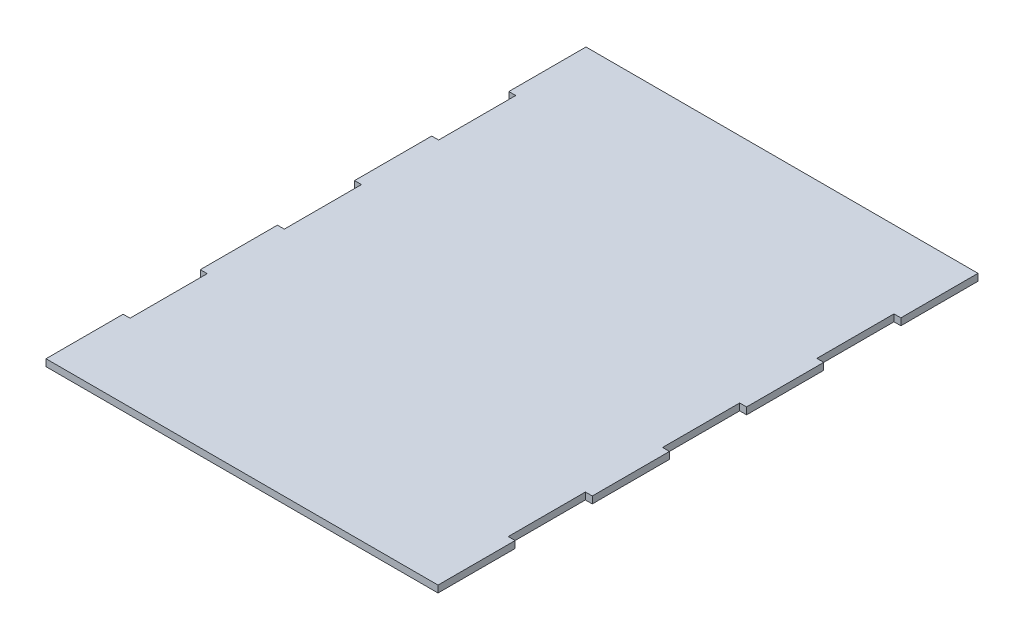
ISO-10303-21;
HEADER;
FILE_DESCRIPTION(('STEP AP214'),'2;1');
FILE_NAME('part.step','',(''),(''),'','','');
FILE_SCHEMA(('AUTOMOTIVE_DESIGN { 1 0 10303 214 1 1 1 1 }'));
ENDSEC;
DATA;
#1=APPLICATION_CONTEXT('core data for automotive mechanical design processes');
#2=APPLICATION_PROTOCOL_DEFINITION('international standard','automotive_design',2000,#1);
#3=PRODUCT_CONTEXT('',#1,'mechanical');
#4=PRODUCT('Part','Part','',(#3));
#5=PRODUCT_RELATED_PRODUCT_CATEGORY('part','',(#4));
#6=PRODUCT_DEFINITION_FORMATION('','',#4);
#7=PRODUCT_DEFINITION_CONTEXT('part definition',#1,'design');
#8=PRODUCT_DEFINITION('design','',#6,#7);
#9=PRODUCT_DEFINITION_SHAPE('','',#8);
#10=(LENGTH_UNIT() NAMED_UNIT(*) SI_UNIT(.MILLI.,.METRE.));
#11=(NAMED_UNIT(*) PLANE_ANGLE_UNIT() SI_UNIT($,.RADIAN.));
#12=(NAMED_UNIT(*) SI_UNIT($,.STERADIAN.) SOLID_ANGLE_UNIT());
#13=UNCERTAINTY_MEASURE_WITH_UNIT(LENGTH_MEASURE(1.E-05),#10,'distance_accuracy_value','');
#14=(GEOMETRIC_REPRESENTATION_CONTEXT(3) GLOBAL_UNCERTAINTY_ASSIGNED_CONTEXT((#13)) GLOBAL_UNIT_ASSIGNED_CONTEXT((#10,
#11,#12)) REPRESENTATION_CONTEXT('',''));
#15=CARTESIAN_POINT('',(0.,0.,0.));
#16=DIRECTION('',(0.,0.,1.));
#17=DIRECTION('',(1.,0.,0.));
#18=AXIS2_PLACEMENT_3D('',#15,#16,#17);
#19=CARTESIAN_POINT('',(-76.7,2.7,-75.4624019285714));
#20=DIRECTION('',(1.,0.,0.));
#21=DIRECTION('',(0.,0.,-1.));
#22=AXIS2_PLACEMENT_3D('',#19,#20,#21);
#23=PLANE('',#22);
#24=DIRECTION('',(0.,0.,1.));
#25=VECTOR('',#24,1.);
#26=CARTESIAN_POINT('',(-76.7,0.,-75.4624019285714));
#27=LINE('',#26,#25);
#28=CARTESIAN_POINT('',(-76.7,0.,-105.6473627));
#29=VERTEX_POINT('',#28);
#30=CARTESIAN_POINT('',(-76.7,0.,-75.4624019285714));
#31=VERTEX_POINT('',#30);
#32=EDGE_CURVE('E249',#29,#31,#27,.T.);
#33=ORIENTED_EDGE('',*,*,#32,.T.);
#34=DIRECTION('',(0.,-1.,0.));
#35=VECTOR('',#34,1.);
#36=CARTESIAN_POINT('',(-76.7,2.7,-75.4624019285714));
#37=LINE('',#36,#35);
#38=CARTESIAN_POINT('',(-76.7,2.7,-75.4624019285714));
#39=VERTEX_POINT('',#38);
#40=EDGE_CURVE('E11',#39,#31,#37,.T.);
#41=ORIENTED_EDGE('',*,*,#40,.F.);
#42=DIRECTION('',(0.,0.,1.));
#43=VECTOR('',#42,1.);
#44=CARTESIAN_POINT('',(-76.7,2.7,-75.4624019285714));
#45=LINE('',#44,#43);
#46=CARTESIAN_POINT('',(-76.7,2.7,-105.6473627));
#47=VERTEX_POINT('',#46);
#48=EDGE_CURVE('E303',#47,#39,#45,.T.);
#49=ORIENTED_EDGE('',*,*,#48,.F.);
#50=DIRECTION('',(0.,-1.,0.));
#51=VECTOR('',#50,1.);
#52=CARTESIAN_POINT('',(-76.7,2.7,-105.6473627));
#53=LINE('',#52,#51);
#54=EDGE_CURVE('E245',#47,#29,#53,.T.);
#55=ORIENTED_EDGE('',*,*,#54,.T.);
#56=EDGE_LOOP('',(#33,#41,#49,#55));
#57=FACE_BOUND('',#56,.T.);
#58=ADVANCED_FACE('F33',(#57),#23,.F.);
#59=CARTESIAN_POINT('',(-76.7,2.7,-75.4624019285714));
#60=DIRECTION('',(0.,0.,-1.));
#61=DIRECTION('',(-1.,0.,0.));
#62=AXIS2_PLACEMENT_3D('',#59,#60,#61);
#63=PLANE('',#62);
#64=DIRECTION('',(1.,0.,0.));
#65=VECTOR('',#64,1.);
#66=CARTESIAN_POINT('',(-76.7,0.,-75.4624019285714));
#67=LINE('',#66,#65);
#68=CARTESIAN_POINT('',(-74.,0.,-75.4624019285714));
#69=VERTEX_POINT('',#68);
#70=EDGE_CURVE('E252',#31,#69,#67,.T.);
#71=ORIENTED_EDGE('',*,*,#70,.T.);
#72=DIRECTION('',(0.,-1.,0.));
#73=VECTOR('',#72,1.);
#74=CARTESIAN_POINT('',(-74.,2.7,-75.4624019285714));
#75=LINE('',#74,#73);
#76=CARTESIAN_POINT('',(-74.,2.7,-75.4624019285714));
#77=VERTEX_POINT('',#76);
#78=EDGE_CURVE('E41',#77,#69,#75,.T.);
#79=ORIENTED_EDGE('',*,*,#78,.F.);
#80=DIRECTION('',(1.,0.,0.));
#81=VECTOR('',#80,1.);
#82=CARTESIAN_POINT('',(-76.7,2.7,-75.4624019285714));
#83=LINE('',#82,#81);
#84=EDGE_CURVE('E152',#39,#77,#83,.T.);
#85=ORIENTED_EDGE('',*,*,#84,.F.);
#86=ORIENTED_EDGE('',*,*,#40,.T.);
#87=EDGE_LOOP('',(#71,#79,#85,#86));
#88=FACE_BOUND('',#87,.T.);
#89=ADVANCED_FACE('F461',(#88),#63,.F.);
#90=CARTESIAN_POINT('',(-74.,2.7,-75.4624019285714));
#91=DIRECTION('',(1.,0.,0.));
#92=DIRECTION('',(0.,0.,-1.));
#93=AXIS2_PLACEMENT_3D('',#90,#91,#92);
#94=PLANE('',#93);
#95=DIRECTION('',(0.,0.,1.));
#96=VECTOR('',#95,1.);
#97=CARTESIAN_POINT('',(-74.,0.,-75.4624019285714));
#98=LINE('',#97,#96);
#99=CARTESIAN_POINT('',(-74.,0.,-45.2774411571429));
#100=VERTEX_POINT('',#99);
#101=EDGE_CURVE('E254',#69,#100,#98,.T.);
#102=ORIENTED_EDGE('',*,*,#101,.T.);
#103=DIRECTION('',(0.,-1.,0.));
#104=VECTOR('',#103,1.);
#105=CARTESIAN_POINT('',(-74.,2.7,-45.2774411571429));
#106=LINE('',#105,#104);
#107=CARTESIAN_POINT('',(-74.,2.7,-45.2774411571429));
#108=VERTEX_POINT('',#107);
#109=EDGE_CURVE('E370',#108,#100,#106,.T.);
#110=ORIENTED_EDGE('',*,*,#109,.F.);
#111=DIRECTION('',(0.,0.,1.));
#112=VECTOR('',#111,1.);
#113=CARTESIAN_POINT('',(-74.,2.7,-75.4624019285714));
#114=LINE('',#113,#112);
#115=EDGE_CURVE('E378',#77,#108,#114,.T.);
#116=ORIENTED_EDGE('',*,*,#115,.F.);
#117=ORIENTED_EDGE('',*,*,#78,.T.);
#118=EDGE_LOOP('',(#102,#110,#116,#117));
#119=FACE_BOUND('',#118,.T.);
#120=ADVANCED_FACE('F376',(#119),#94,.F.);
#121=CARTESIAN_POINT('',(-76.7,2.7,-45.2774411571429));
#122=DIRECTION('',(0.,0.,1.));
#123=DIRECTION('',(1.,0.,0.));
#124=AXIS2_PLACEMENT_3D('',#121,#122,#123);
#125=PLANE('',#124);
#126=DIRECTION('',(-1.,0.,0.));
#127=VECTOR('',#126,1.);
#128=CARTESIAN_POINT('',(-76.7,0.,-45.2774411571429));
#129=LINE('',#128,#127);
#130=CARTESIAN_POINT('',(-76.7,0.,-45.2774411571429));
#131=VERTEX_POINT('',#130);
#132=EDGE_CURVE('E256',#100,#131,#129,.T.);
#133=ORIENTED_EDGE('',*,*,#132,.T.);
#134=DIRECTION('',(0.,-1.,0.));
#135=VECTOR('',#134,1.);
#136=CARTESIAN_POINT('',(-76.7,2.7,-45.2774411571429));
#137=LINE('',#136,#135);
#138=CARTESIAN_POINT('',(-76.7,2.7,-45.2774411571429));
#139=VERTEX_POINT('',#138);
#140=EDGE_CURVE('E367',#139,#131,#137,.T.);
#141=ORIENTED_EDGE('',*,*,#140,.F.);
#142=DIRECTION('',(-1.,0.,0.));
#143=VECTOR('',#142,1.);
#144=CARTESIAN_POINT('',(-76.7,2.7,-45.2774411571429));
#145=LINE('',#144,#143);
#146=EDGE_CURVE('E396',#108,#139,#145,.T.);
#147=ORIENTED_EDGE('',*,*,#146,.F.);
#148=ORIENTED_EDGE('',*,*,#109,.T.);
#149=EDGE_LOOP('',(#133,#141,#147,#148));
#150=FACE_BOUND('',#149,.T.);
#151=ADVANCED_FACE('F387',(#150),#125,.F.);
#152=CARTESIAN_POINT('',(-76.7,2.7,-15.0924803857143));
#153=DIRECTION('',(1.,0.,0.));
#154=DIRECTION('',(0.,0.,-1.));
#155=AXIS2_PLACEMENT_3D('',#152,#153,#154);
#156=PLANE('',#155);
#157=DIRECTION('',(0.,0.,1.));
#158=VECTOR('',#157,1.);
#159=CARTESIAN_POINT('',(-76.7,0.,-15.0924803857143));
#160=LINE('',#159,#158);
#161=CARTESIAN_POINT('',(-76.7,0.,-15.0924803857143));
#162=VERTEX_POINT('',#161);
#163=EDGE_CURVE('E258',#131,#162,#160,.T.);
#164=ORIENTED_EDGE('',*,*,#163,.T.);
#165=DIRECTION('',(0.,-1.,0.));
#166=VECTOR('',#165,1.);
#167=CARTESIAN_POINT('',(-76.7,2.7,-15.0924803857143));
#168=LINE('',#167,#166);
#169=CARTESIAN_POINT('',(-76.7,2.7,-15.0924803857143));
#170=VERTEX_POINT('',#169);
#171=EDGE_CURVE('E364',#170,#162,#168,.T.);
#172=ORIENTED_EDGE('',*,*,#171,.F.);
#173=DIRECTION('',(0.,0.,1.));
#174=VECTOR('',#173,1.);
#175=CARTESIAN_POINT('',(-76.7,2.7,-15.0924803857143));
#176=LINE('',#175,#174);
#177=EDGE_CURVE('E393',#139,#170,#176,.T.);
#178=ORIENTED_EDGE('',*,*,#177,.F.);
#179=ORIENTED_EDGE('',*,*,#140,.T.);
#180=EDGE_LOOP('',(#164,#172,#178,#179));
#181=FACE_BOUND('',#180,.T.);
#182=ADVANCED_FACE('F391',(#181),#156,.F.);
#183=CARTESIAN_POINT('',(-76.7,2.7,-15.0924803857143));
#184=DIRECTION('',(0.,0.,-1.));
#185=DIRECTION('',(-1.,0.,0.));
#186=AXIS2_PLACEMENT_3D('',#183,#184,#185);
#187=PLANE('',#186);
#188=DIRECTION('',(1.,0.,0.));
#189=VECTOR('',#188,1.);
#190=CARTESIAN_POINT('',(-76.7,0.,-15.0924803857143));
#191=LINE('',#190,#189);
#192=CARTESIAN_POINT('',(-74.,0.,-15.0924803857143));
#193=VERTEX_POINT('',#192);
#194=EDGE_CURVE('E260',#162,#193,#191,.T.);
#195=ORIENTED_EDGE('',*,*,#194,.T.);
#196=DIRECTION('',(0.,-1.,0.));
#197=VECTOR('',#196,1.);
#198=CARTESIAN_POINT('',(-74.,2.7,-15.0924803857143));
#199=LINE('',#198,#197);
#200=CARTESIAN_POINT('',(-74.,2.7,-15.0924803857143));
#201=VERTEX_POINT('',#200);
#202=EDGE_CURVE('E361',#201,#193,#199,.T.);
#203=ORIENTED_EDGE('',*,*,#202,.F.);
#204=DIRECTION('',(1.,0.,0.));
#205=VECTOR('',#204,1.);
#206=CARTESIAN_POINT('',(-76.7,2.7,-15.0924803857143));
#207=LINE('',#206,#205);
#208=EDGE_CURVE('E395',#170,#201,#207,.T.);
#209=ORIENTED_EDGE('',*,*,#208,.F.);
#210=ORIENTED_EDGE('',*,*,#171,.T.);
#211=EDGE_LOOP('',(#195,#203,#209,#210));
#212=FACE_BOUND('',#211,.T.);
#213=ADVANCED_FACE('F474',(#212),#187,.F.);
#214=CARTESIAN_POINT('',(-74.,2.7,-15.0924803857143));
#215=DIRECTION('',(1.,0.,0.));
#216=DIRECTION('',(0.,0.,-1.));
#217=AXIS2_PLACEMENT_3D('',#214,#215,#216);
#218=PLANE('',#217);
#219=DIRECTION('',(0.,0.,1.));
#220=VECTOR('',#219,1.);
#221=CARTESIAN_POINT('',(-74.,0.,-15.0924803857143));
#222=LINE('',#221,#220);
#223=CARTESIAN_POINT('',(-74.,0.,15.0924803857143));
#224=VERTEX_POINT('',#223);
#225=EDGE_CURVE('E262',#193,#224,#222,.T.);
#226=ORIENTED_EDGE('',*,*,#225,.T.);
#227=DIRECTION('',(0.,-1.,0.));
#228=VECTOR('',#227,1.);
#229=CARTESIAN_POINT('',(-74.,2.7,15.0924803857143));
#230=LINE('',#229,#228);
#231=CARTESIAN_POINT('',(-74.,2.7,15.0924803857143));
#232=VERTEX_POINT('',#231);
#233=EDGE_CURVE('E358',#232,#224,#230,.T.);
#234=ORIENTED_EDGE('',*,*,#233,.F.);
#235=DIRECTION('',(0.,0.,1.));
#236=VECTOR('',#235,1.);
#237=CARTESIAN_POINT('',(-74.,2.7,-15.0924803857143));
#238=LINE('',#237,#236);
#239=EDGE_CURVE('E398',#201,#232,#238,.T.);
#240=ORIENTED_EDGE('',*,*,#239,.F.);
#241=ORIENTED_EDGE('',*,*,#202,.T.);
#242=EDGE_LOOP('',(#226,#234,#240,#241));
#243=FACE_BOUND('',#242,.T.);
#244=ADVANCED_FACE('F477',(#243),#218,.F.);
#245=CARTESIAN_POINT('',(-76.7,2.7,15.0924803857143));
#246=DIRECTION('',(0.,0.,1.));
#247=DIRECTION('',(1.,0.,0.));
#248=AXIS2_PLACEMENT_3D('',#245,#246,#247);
#249=PLANE('',#248);
#250=DIRECTION('',(-1.,0.,0.));
#251=VECTOR('',#250,1.);
#252=CARTESIAN_POINT('',(-76.7,0.,15.0924803857143));
#253=LINE('',#252,#251);
#254=CARTESIAN_POINT('',(-76.7,0.,15.0924803857143));
#255=VERTEX_POINT('',#254);
#256=EDGE_CURVE('E264',#224,#255,#253,.T.);
#257=ORIENTED_EDGE('',*,*,#256,.T.);
#258=DIRECTION('',(0.,-1.,0.));
#259=VECTOR('',#258,1.);
#260=CARTESIAN_POINT('',(-76.7,2.7,15.0924803857143));
#261=LINE('',#260,#259);
#262=CARTESIAN_POINT('',(-76.7,2.7,15.0924803857143));
#263=VERTEX_POINT('',#262);
#264=EDGE_CURVE('E355',#263,#255,#261,.T.);
#265=ORIENTED_EDGE('',*,*,#264,.F.);
#266=DIRECTION('',(-1.,0.,0.));
#267=VECTOR('',#266,1.);
#268=CARTESIAN_POINT('',(-76.7,2.7,15.0924803857143));
#269=LINE('',#268,#267);
#270=EDGE_CURVE('E404',#232,#263,#269,.T.);
#271=ORIENTED_EDGE('',*,*,#270,.F.);
#272=ORIENTED_EDGE('',*,*,#233,.T.);
#273=EDGE_LOOP('',(#257,#265,#271,#272));
#274=FACE_BOUND('',#273,.T.);
#275=ADVANCED_FACE('F481',(#274),#249,.F.);
#276=CARTESIAN_POINT('',(-76.7,2.7,45.2774411571429));
#277=DIRECTION('',(1.,0.,0.));
#278=DIRECTION('',(0.,0.,-1.));
#279=AXIS2_PLACEMENT_3D('',#276,#277,#278);
#280=PLANE('',#279);
#281=DIRECTION('',(0.,0.,1.));
#282=VECTOR('',#281,1.);
#283=CARTESIAN_POINT('',(-76.7,0.,45.2774411571429));
#284=LINE('',#283,#282);
#285=CARTESIAN_POINT('',(-76.7,0.,45.2774411571429));
#286=VERTEX_POINT('',#285);
#287=EDGE_CURVE('E266',#255,#286,#284,.T.);
#288=ORIENTED_EDGE('',*,*,#287,.T.);
#289=DIRECTION('',(0.,-1.,0.));
#290=VECTOR('',#289,1.);
#291=CARTESIAN_POINT('',(-76.7,2.7,45.2774411571429));
#292=LINE('',#291,#290);
#293=CARTESIAN_POINT('',(-76.7,2.7,45.2774411571429));
#294=VERTEX_POINT('',#293);
#295=EDGE_CURVE('E352',#294,#286,#292,.T.);
#296=ORIENTED_EDGE('',*,*,#295,.F.);
#297=DIRECTION('',(0.,0.,1.));
#298=VECTOR('',#297,1.);
#299=CARTESIAN_POINT('',(-76.7,2.7,45.2774411571429));
#300=LINE('',#299,#298);
#301=EDGE_CURVE('E406',#263,#294,#300,.T.);
#302=ORIENTED_EDGE('',*,*,#301,.F.);
#303=ORIENTED_EDGE('',*,*,#264,.T.);
#304=EDGE_LOOP('',(#288,#296,#302,#303));
#305=FACE_BOUND('',#304,.T.);
#306=ADVANCED_FACE('F485',(#305),#280,.F.);
#307=CARTESIAN_POINT('',(-76.7,2.7,45.2774411571429));
#308=DIRECTION('',(0.,0.,-1.));
#309=DIRECTION('',(-1.,0.,0.));
#310=AXIS2_PLACEMENT_3D('',#307,#308,#309);
#311=PLANE('',#310);
#312=DIRECTION('',(1.,0.,0.));
#313=VECTOR('',#312,1.);
#314=CARTESIAN_POINT('',(-76.7,0.,45.2774411571429));
#315=LINE('',#314,#313);
#316=CARTESIAN_POINT('',(-74.,0.,45.2774411571428));
#317=VERTEX_POINT('',#316);
#318=EDGE_CURVE('E268',#286,#317,#315,.T.);
#319=ORIENTED_EDGE('',*,*,#318,.T.);
#320=DIRECTION('',(0.,-1.,0.));
#321=VECTOR('',#320,1.);
#322=CARTESIAN_POINT('',(-74.,2.7,45.2774411571428));
#323=LINE('',#322,#321);
#324=CARTESIAN_POINT('',(-74.,2.7,45.2774411571428));
#325=VERTEX_POINT('',#324);
#326=EDGE_CURVE('E349',#325,#317,#323,.T.);
#327=ORIENTED_EDGE('',*,*,#326,.F.);
#328=DIRECTION('',(1.,0.,0.));
#329=VECTOR('',#328,1.);
#330=CARTESIAN_POINT('',(-76.7,2.7,45.2774411571429));
#331=LINE('',#330,#329);
#332=EDGE_CURVE('E408',#294,#325,#331,.T.);
#333=ORIENTED_EDGE('',*,*,#332,.F.);
#334=ORIENTED_EDGE('',*,*,#295,.T.);
#335=EDGE_LOOP('',(#319,#327,#333,#334));
#336=FACE_BOUND('',#335,.T.);
#337=ADVANCED_FACE('F489',(#336),#311,.F.);
#338=CARTESIAN_POINT('',(-74.,2.7,45.2774411571428));
#339=DIRECTION('',(1.,0.,0.));
#340=DIRECTION('',(0.,0.,-1.));
#341=AXIS2_PLACEMENT_3D('',#338,#339,#340);
#342=PLANE('',#341);
#343=DIRECTION('',(0.,0.,1.));
#344=VECTOR('',#343,1.);
#345=CARTESIAN_POINT('',(-74.,0.,45.2774411571428));
#346=LINE('',#345,#344);
#347=CARTESIAN_POINT('',(-74.,0.,75.4624019285714));
#348=VERTEX_POINT('',#347);
#349=EDGE_CURVE('E270',#317,#348,#346,.T.);
#350=ORIENTED_EDGE('',*,*,#349,.T.);
#351=DIRECTION('',(0.,-1.,0.));
#352=VECTOR('',#351,1.);
#353=CARTESIAN_POINT('',(-74.,2.7,75.4624019285714));
#354=LINE('',#353,#352);
#355=CARTESIAN_POINT('',(-74.,2.7,75.4624019285714));
#356=VERTEX_POINT('',#355);
#357=EDGE_CURVE('E346',#356,#348,#354,.T.);
#358=ORIENTED_EDGE('',*,*,#357,.F.);
#359=DIRECTION('',(0.,0.,1.));
#360=VECTOR('',#359,1.);
#361=CARTESIAN_POINT('',(-74.,2.7,45.2774411571428));
#362=LINE('',#361,#360);
#363=EDGE_CURVE('E410',#325,#356,#362,.T.);
#364=ORIENTED_EDGE('',*,*,#363,.F.);
#365=ORIENTED_EDGE('',*,*,#326,.T.);
#366=EDGE_LOOP('',(#350,#358,#364,#365));
#367=FACE_BOUND('',#366,.T.);
#368=ADVANCED_FACE('F493',(#367),#342,.F.);
#369=CARTESIAN_POINT('',(-76.7,2.7,75.4624019285714));
#370=DIRECTION('',(0.,0.,1.));
#371=DIRECTION('',(1.,0.,0.));
#372=AXIS2_PLACEMENT_3D('',#369,#370,#371);
#373=PLANE('',#372);
#374=DIRECTION('',(-1.,0.,0.));
#375=VECTOR('',#374,1.);
#376=CARTESIAN_POINT('',(-76.7,0.,75.4624019285714));
#377=LINE('',#376,#375);
#378=CARTESIAN_POINT('',(-76.7,0.,75.4624019285714));
#379=VERTEX_POINT('',#378);
#380=EDGE_CURVE('E272',#348,#379,#377,.T.);
#381=ORIENTED_EDGE('',*,*,#380,.T.);
#382=DIRECTION('',(0.,-1.,0.));
#383=VECTOR('',#382,1.);
#384=CARTESIAN_POINT('',(-76.7,2.7,75.4624019285714));
#385=LINE('',#384,#383);
#386=CARTESIAN_POINT('',(-76.7,2.7,75.4624019285714));
#387=VERTEX_POINT('',#386);
#388=EDGE_CURVE('E343',#387,#379,#385,.T.);
#389=ORIENTED_EDGE('',*,*,#388,.F.);
#390=DIRECTION('',(-1.,0.,0.));
#391=VECTOR('',#390,1.);
#392=CARTESIAN_POINT('',(-76.7,2.7,75.4624019285714));
#393=LINE('',#392,#391);
#394=EDGE_CURVE('E412',#356,#387,#393,.T.);
#395=ORIENTED_EDGE('',*,*,#394,.F.);
#396=ORIENTED_EDGE('',*,*,#357,.T.);
#397=EDGE_LOOP('',(#381,#389,#395,#396));
#398=FACE_BOUND('',#397,.T.);
#399=ADVANCED_FACE('F497',(#398),#373,.F.);
#400=CARTESIAN_POINT('',(-76.7,2.7,105.6473627));
#401=DIRECTION('',(1.,0.,0.));
#402=DIRECTION('',(0.,0.,-1.));
#403=AXIS2_PLACEMENT_3D('',#400,#401,#402);
#404=PLANE('',#403);
#405=DIRECTION('',(0.,0.,1.));
#406=VECTOR('',#405,1.);
#407=CARTESIAN_POINT('',(-76.7,0.,105.6473627));
#408=LINE('',#407,#406);
#409=CARTESIAN_POINT('',(-76.7,0.,105.6473627));
#410=VERTEX_POINT('',#409);
#411=EDGE_CURVE('E274',#379,#410,#408,.T.);
#412=ORIENTED_EDGE('',*,*,#411,.T.);
#413=DIRECTION('',(0.,-1.,0.));
#414=VECTOR('',#413,1.);
#415=CARTESIAN_POINT('',(-76.7,2.7,105.6473627));
#416=LINE('',#415,#414);
#417=CARTESIAN_POINT('',(-76.7,2.7,105.6473627));
#418=VERTEX_POINT('',#417);
#419=EDGE_CURVE('E340',#418,#410,#416,.T.);
#420=ORIENTED_EDGE('',*,*,#419,.F.);
#421=DIRECTION('',(0.,0.,1.));
#422=VECTOR('',#421,1.);
#423=CARTESIAN_POINT('',(-76.7,2.7,105.6473627));
#424=LINE('',#423,#422);
#425=EDGE_CURVE('E414',#387,#418,#424,.T.);
#426=ORIENTED_EDGE('',*,*,#425,.F.);
#427=ORIENTED_EDGE('',*,*,#388,.T.);
#428=EDGE_LOOP('',(#412,#420,#426,#427));
#429=FACE_BOUND('',#428,.T.);
#430=ADVANCED_FACE('F501',(#429),#404,.F.);
#431=CARTESIAN_POINT('',(76.7,2.7,105.6473627));
#432=DIRECTION('',(0.,0.,-1.));
#433=DIRECTION('',(-1.,0.,0.));
#434=AXIS2_PLACEMENT_3D('',#431,#432,#433);
#435=PLANE('',#434);
#436=DIRECTION('',(1.,0.,0.));
#437=VECTOR('',#436,1.);
#438=CARTESIAN_POINT('',(76.7,0.,105.6473627));
#439=LINE('',#438,#437);
#440=CARTESIAN_POINT('',(76.7,0.,105.6473627));
#441=VERTEX_POINT('',#440);
#442=EDGE_CURVE('E276',#410,#441,#439,.T.);
#443=ORIENTED_EDGE('',*,*,#442,.T.);
#444=DIRECTION('',(0.,-1.,0.));
#445=VECTOR('',#444,1.);
#446=CARTESIAN_POINT('',(76.7,2.7,105.6473627));
#447=LINE('',#446,#445);
#448=CARTESIAN_POINT('',(76.7,2.7,105.6473627));
#449=VERTEX_POINT('',#448);
#450=EDGE_CURVE('E337',#449,#441,#447,.T.);
#451=ORIENTED_EDGE('',*,*,#450,.F.);
#452=DIRECTION('',(1.,0.,0.));
#453=VECTOR('',#452,1.);
#454=CARTESIAN_POINT('',(76.7,2.7,105.6473627));
#455=LINE('',#454,#453);
#456=EDGE_CURVE('E416',#418,#449,#455,.T.);
#457=ORIENTED_EDGE('',*,*,#456,.F.);
#458=ORIENTED_EDGE('',*,*,#419,.T.);
#459=EDGE_LOOP('',(#443,#451,#457,#458));
#460=FACE_BOUND('',#459,.T.);
#461=ADVANCED_FACE('F505',(#460),#435,.F.);
#462=CARTESIAN_POINT('',(76.7,2.7,105.6473627));
#463=DIRECTION('',(-1.,0.,0.));
#464=DIRECTION('',(0.,0.,1.));
#465=AXIS2_PLACEMENT_3D('',#462,#463,#464);
#466=PLANE('',#465);
#467=DIRECTION('',(0.,0.,-1.));
#468=VECTOR('',#467,1.);
#469=CARTESIAN_POINT('',(76.7,0.,105.6473627));
#470=LINE('',#469,#468);
#471=CARTESIAN_POINT('',(76.7,0.,75.4624019285714));
#472=VERTEX_POINT('',#471);
#473=EDGE_CURVE('E278',#441,#472,#470,.T.);
#474=ORIENTED_EDGE('',*,*,#473,.T.);
#475=DIRECTION('',(0.,-1.,0.));
#476=VECTOR('',#475,1.);
#477=CARTESIAN_POINT('',(76.7,2.7,75.4624019285714));
#478=LINE('',#477,#476);
#479=CARTESIAN_POINT('',(76.7,2.7,75.4624019285714));
#480=VERTEX_POINT('',#479);
#481=EDGE_CURVE('E334',#480,#472,#478,.T.);
#482=ORIENTED_EDGE('',*,*,#481,.F.);
#483=DIRECTION('',(0.,0.,-1.));
#484=VECTOR('',#483,1.);
#485=CARTESIAN_POINT('',(76.7,2.7,105.6473627));
#486=LINE('',#485,#484);
#487=EDGE_CURVE('E418',#449,#480,#486,.T.);
#488=ORIENTED_EDGE('',*,*,#487,.F.);
#489=ORIENTED_EDGE('',*,*,#450,.T.);
#490=EDGE_LOOP('',(#474,#482,#488,#489));
#491=FACE_BOUND('',#490,.T.);
#492=ADVANCED_FACE('F509',(#491),#466,.F.);
#493=CARTESIAN_POINT('',(76.7,2.7,75.4624019285714));
#494=DIRECTION('',(0.,0.,1.));
#495=DIRECTION('',(1.,0.,0.));
#496=AXIS2_PLACEMENT_3D('',#493,#494,#495);
#497=PLANE('',#496);
#498=DIRECTION('',(-1.,0.,0.));
#499=VECTOR('',#498,1.);
#500=CARTESIAN_POINT('',(76.7,0.,75.4624019285714));
#501=LINE('',#500,#499);
#502=CARTESIAN_POINT('',(74.,0.,75.4624019285714));
#503=VERTEX_POINT('',#502);
#504=EDGE_CURVE('E280',#472,#503,#501,.T.);
#505=ORIENTED_EDGE('',*,*,#504,.T.);
#506=DIRECTION('',(0.,-1.,0.));
#507=VECTOR('',#506,1.);
#508=CARTESIAN_POINT('',(74.,2.7,75.4624019285714));
#509=LINE('',#508,#507);
#510=CARTESIAN_POINT('',(74.,2.7,75.4624019285714));
#511=VERTEX_POINT('',#510);
#512=EDGE_CURVE('E331',#511,#503,#509,.T.);
#513=ORIENTED_EDGE('',*,*,#512,.F.);
#514=DIRECTION('',(-1.,0.,0.));
#515=VECTOR('',#514,1.);
#516=CARTESIAN_POINT('',(76.7,2.7,75.4624019285714));
#517=LINE('',#516,#515);
#518=EDGE_CURVE('E420',#480,#511,#517,.T.);
#519=ORIENTED_EDGE('',*,*,#518,.F.);
#520=ORIENTED_EDGE('',*,*,#481,.T.);
#521=EDGE_LOOP('',(#505,#513,#519,#520));
#522=FACE_BOUND('',#521,.T.);
#523=ADVANCED_FACE('F513',(#522),#497,.F.);
#524=CARTESIAN_POINT('',(74.,2.7,45.2774411571428));
#525=DIRECTION('',(-1.,0.,0.));
#526=DIRECTION('',(0.,0.,1.));
#527=AXIS2_PLACEMENT_3D('',#524,#525,#526);
#528=PLANE('',#527);
#529=DIRECTION('',(0.,0.,-1.));
#530=VECTOR('',#529,1.);
#531=CARTESIAN_POINT('',(74.,0.,45.2774411571428));
#532=LINE('',#531,#530);
#533=CARTESIAN_POINT('',(74.,0.,45.2774411571428));
#534=VERTEX_POINT('',#533);
#535=EDGE_CURVE('E282',#503,#534,#532,.T.);
#536=ORIENTED_EDGE('',*,*,#535,.T.);
#537=DIRECTION('',(0.,-1.,0.));
#538=VECTOR('',#537,1.);
#539=CARTESIAN_POINT('',(74.,2.7,45.2774411571428));
#540=LINE('',#539,#538);
#541=CARTESIAN_POINT('',(74.,2.7,45.2774411571428));
#542=VERTEX_POINT('',#541);
#543=EDGE_CURVE('E328',#542,#534,#540,.T.);
#544=ORIENTED_EDGE('',*,*,#543,.F.);
#545=DIRECTION('',(0.,0.,-1.));
#546=VECTOR('',#545,1.);
#547=CARTESIAN_POINT('',(74.,2.7,45.2774411571428));
#548=LINE('',#547,#546);
#549=EDGE_CURVE('E422',#511,#542,#548,.T.);
#550=ORIENTED_EDGE('',*,*,#549,.F.);
#551=ORIENTED_EDGE('',*,*,#512,.T.);
#552=EDGE_LOOP('',(#536,#544,#550,#551));
#553=FACE_BOUND('',#552,.T.);
#554=ADVANCED_FACE('F517',(#553),#528,.F.);
#555=CARTESIAN_POINT('',(76.7,2.7,45.2774411571429));
#556=DIRECTION('',(0.,0.,-1.));
#557=DIRECTION('',(-1.,0.,0.));
#558=AXIS2_PLACEMENT_3D('',#555,#556,#557);
#559=PLANE('',#558);
#560=DIRECTION('',(1.,0.,0.));
#561=VECTOR('',#560,1.);
#562=CARTESIAN_POINT('',(76.7,0.,45.2774411571429));
#563=LINE('',#562,#561);
#564=CARTESIAN_POINT('',(76.7,0.,45.2774411571429));
#565=VERTEX_POINT('',#564);
#566=EDGE_CURVE('E284',#534,#565,#563,.T.);
#567=ORIENTED_EDGE('',*,*,#566,.T.);
#568=DIRECTION('',(0.,-1.,0.));
#569=VECTOR('',#568,1.);
#570=CARTESIAN_POINT('',(76.7,2.7,45.2774411571429));
#571=LINE('',#570,#569);
#572=CARTESIAN_POINT('',(76.7,2.7,45.2774411571429));
#573=VERTEX_POINT('',#572);
#574=EDGE_CURVE('E325',#573,#565,#571,.T.);
#575=ORIENTED_EDGE('',*,*,#574,.F.);
#576=DIRECTION('',(1.,0.,0.));
#577=VECTOR('',#576,1.);
#578=CARTESIAN_POINT('',(76.7,2.7,45.2774411571429));
#579=LINE('',#578,#577);
#580=EDGE_CURVE('E424',#542,#573,#579,.T.);
#581=ORIENTED_EDGE('',*,*,#580,.F.);
#582=ORIENTED_EDGE('',*,*,#543,.T.);
#583=EDGE_LOOP('',(#567,#575,#581,#582));
#584=FACE_BOUND('',#583,.T.);
#585=ADVANCED_FACE('F521',(#584),#559,.F.);
#586=CARTESIAN_POINT('',(76.7,2.7,45.2774411571429));
#587=DIRECTION('',(-1.,0.,0.));
#588=DIRECTION('',(0.,0.,1.));
#589=AXIS2_PLACEMENT_3D('',#586,#587,#588);
#590=PLANE('',#589);
#591=DIRECTION('',(0.,0.,-1.));
#592=VECTOR('',#591,1.);
#593=CARTESIAN_POINT('',(76.7,0.,45.2774411571429));
#594=LINE('',#593,#592);
#595=CARTESIAN_POINT('',(76.7,0.,15.0924803857143));
#596=VERTEX_POINT('',#595);
#597=EDGE_CURVE('E286',#565,#596,#594,.T.);
#598=ORIENTED_EDGE('',*,*,#597,.T.);
#599=DIRECTION('',(0.,-1.,0.));
#600=VECTOR('',#599,1.);
#601=CARTESIAN_POINT('',(76.7,2.7,15.0924803857143));
#602=LINE('',#601,#600);
#603=CARTESIAN_POINT('',(76.7,2.7,15.0924803857143));
#604=VERTEX_POINT('',#603);
#605=EDGE_CURVE('E322',#604,#596,#602,.T.);
#606=ORIENTED_EDGE('',*,*,#605,.F.);
#607=DIRECTION('',(0.,0.,-1.));
#608=VECTOR('',#607,1.);
#609=CARTESIAN_POINT('',(76.7,2.7,45.2774411571429));
#610=LINE('',#609,#608);
#611=EDGE_CURVE('E426',#573,#604,#610,.T.);
#612=ORIENTED_EDGE('',*,*,#611,.F.);
#613=ORIENTED_EDGE('',*,*,#574,.T.);
#614=EDGE_LOOP('',(#598,#606,#612,#613));
#615=FACE_BOUND('',#614,.T.);
#616=ADVANCED_FACE('F525',(#615),#590,.F.);
#617=CARTESIAN_POINT('',(76.7,2.7,15.0924803857143));
#618=DIRECTION('',(0.,0.,1.));
#619=DIRECTION('',(1.,0.,0.));
#620=AXIS2_PLACEMENT_3D('',#617,#618,#619);
#621=PLANE('',#620);
#622=DIRECTION('',(-1.,0.,0.));
#623=VECTOR('',#622,1.);
#624=CARTESIAN_POINT('',(76.7,0.,15.0924803857143));
#625=LINE('',#624,#623);
#626=CARTESIAN_POINT('',(74.,0.,15.0924803857143));
#627=VERTEX_POINT('',#626);
#628=EDGE_CURVE('E288',#596,#627,#625,.T.);
#629=ORIENTED_EDGE('',*,*,#628,.T.);
#630=DIRECTION('',(0.,-1.,0.));
#631=VECTOR('',#630,1.);
#632=CARTESIAN_POINT('',(74.,2.7,15.0924803857143));
#633=LINE('',#632,#631);
#634=CARTESIAN_POINT('',(74.,2.7,15.0924803857143));
#635=VERTEX_POINT('',#634);
#636=EDGE_CURVE('E319',#635,#627,#633,.T.);
#637=ORIENTED_EDGE('',*,*,#636,.F.);
#638=DIRECTION('',(-1.,0.,0.));
#639=VECTOR('',#638,1.);
#640=CARTESIAN_POINT('',(76.7,2.7,15.0924803857143));
#641=LINE('',#640,#639);
#642=EDGE_CURVE('E428',#604,#635,#641,.T.);
#643=ORIENTED_EDGE('',*,*,#642,.F.);
#644=ORIENTED_EDGE('',*,*,#605,.T.);
#645=EDGE_LOOP('',(#629,#637,#643,#644));
#646=FACE_BOUND('',#645,.T.);
#647=ADVANCED_FACE('F529',(#646),#621,.F.);
#648=CARTESIAN_POINT('',(74.,2.7,-15.0924803857143));
#649=DIRECTION('',(-1.,0.,0.));
#650=DIRECTION('',(0.,0.,1.));
#651=AXIS2_PLACEMENT_3D('',#648,#649,#650);
#652=PLANE('',#651);
#653=DIRECTION('',(0.,0.,-1.));
#654=VECTOR('',#653,1.);
#655=CARTESIAN_POINT('',(74.,0.,-15.0924803857143));
#656=LINE('',#655,#654);
#657=CARTESIAN_POINT('',(74.,0.,-15.0924803857143));
#658=VERTEX_POINT('',#657);
#659=EDGE_CURVE('E290',#627,#658,#656,.T.);
#660=ORIENTED_EDGE('',*,*,#659,.T.);
#661=DIRECTION('',(0.,-1.,0.));
#662=VECTOR('',#661,1.);
#663=CARTESIAN_POINT('',(74.,2.7,-15.0924803857143));
#664=LINE('',#663,#662);
#665=CARTESIAN_POINT('',(74.,2.7,-15.0924803857143));
#666=VERTEX_POINT('',#665);
#667=EDGE_CURVE('E316',#666,#658,#664,.T.);
#668=ORIENTED_EDGE('',*,*,#667,.F.);
#669=DIRECTION('',(0.,0.,-1.));
#670=VECTOR('',#669,1.);
#671=CARTESIAN_POINT('',(74.,2.7,-15.0924803857143));
#672=LINE('',#671,#670);
#673=EDGE_CURVE('E430',#635,#666,#672,.T.);
#674=ORIENTED_EDGE('',*,*,#673,.F.);
#675=ORIENTED_EDGE('',*,*,#636,.T.);
#676=EDGE_LOOP('',(#660,#668,#674,#675));
#677=FACE_BOUND('',#676,.T.);
#678=ADVANCED_FACE('F533',(#677),#652,.F.);
#679=CARTESIAN_POINT('',(76.7,2.7,-15.0924803857143));
#680=DIRECTION('',(0.,0.,-1.));
#681=DIRECTION('',(-1.,0.,0.));
#682=AXIS2_PLACEMENT_3D('',#679,#680,#681);
#683=PLANE('',#682);
#684=DIRECTION('',(1.,0.,0.));
#685=VECTOR('',#684,1.);
#686=CARTESIAN_POINT('',(76.7,0.,-15.0924803857143));
#687=LINE('',#686,#685);
#688=CARTESIAN_POINT('',(76.7,0.,-15.0924803857143));
#689=VERTEX_POINT('',#688);
#690=EDGE_CURVE('E292',#658,#689,#687,.T.);
#691=ORIENTED_EDGE('',*,*,#690,.T.);
#692=DIRECTION('',(0.,-1.,0.));
#693=VECTOR('',#692,1.);
#694=CARTESIAN_POINT('',(76.7,2.7,-15.0924803857143));
#695=LINE('',#694,#693);
#696=CARTESIAN_POINT('',(76.7,2.7,-15.0924803857143));
#697=VERTEX_POINT('',#696);
#698=EDGE_CURVE('E313',#697,#689,#695,.T.);
#699=ORIENTED_EDGE('',*,*,#698,.F.);
#700=DIRECTION('',(1.,0.,0.));
#701=VECTOR('',#700,1.);
#702=CARTESIAN_POINT('',(76.7,2.7,-15.0924803857143));
#703=LINE('',#702,#701);
#704=EDGE_CURVE('E432',#666,#697,#703,.T.);
#705=ORIENTED_EDGE('',*,*,#704,.F.);
#706=ORIENTED_EDGE('',*,*,#667,.T.);
#707=EDGE_LOOP('',(#691,#699,#705,#706));
#708=FACE_BOUND('',#707,.T.);
#709=ADVANCED_FACE('F537',(#708),#683,.F.);
#710=CARTESIAN_POINT('',(76.7,2.7,-15.0924803857143));
#711=DIRECTION('',(-1.,0.,0.));
#712=DIRECTION('',(0.,0.,1.));
#713=AXIS2_PLACEMENT_3D('',#710,#711,#712);
#714=PLANE('',#713);
#715=DIRECTION('',(0.,0.,-1.));
#716=VECTOR('',#715,1.);
#717=CARTESIAN_POINT('',(76.7,0.,-15.0924803857143));
#718=LINE('',#717,#716);
#719=CARTESIAN_POINT('',(76.7,0.,-45.2774411571429));
#720=VERTEX_POINT('',#719);
#721=EDGE_CURVE('E294',#689,#720,#718,.T.);
#722=ORIENTED_EDGE('',*,*,#721,.T.);
#723=DIRECTION('',(0.,-1.,0.));
#724=VECTOR('',#723,1.);
#725=CARTESIAN_POINT('',(76.7,2.7,-45.2774411571429));
#726=LINE('',#725,#724);
#727=CARTESIAN_POINT('',(76.7,2.7,-45.2774411571429));
#728=VERTEX_POINT('',#727);
#729=EDGE_CURVE('E310',#728,#720,#726,.T.);
#730=ORIENTED_EDGE('',*,*,#729,.F.);
#731=DIRECTION('',(0.,0.,-1.));
#732=VECTOR('',#731,1.);
#733=CARTESIAN_POINT('',(76.7,2.7,-15.0924803857143));
#734=LINE('',#733,#732);
#735=EDGE_CURVE('E434',#697,#728,#734,.T.);
#736=ORIENTED_EDGE('',*,*,#735,.F.);
#737=ORIENTED_EDGE('',*,*,#698,.T.);
#738=EDGE_LOOP('',(#722,#730,#736,#737));
#739=FACE_BOUND('',#738,.T.);
#740=ADVANCED_FACE('F541',(#739),#714,.F.);
#741=CARTESIAN_POINT('',(76.7,2.7,-45.2774411571429));
#742=DIRECTION('',(0.,0.,1.));
#743=DIRECTION('',(1.,0.,0.));
#744=AXIS2_PLACEMENT_3D('',#741,#742,#743);
#745=PLANE('',#744);
#746=DIRECTION('',(-1.,0.,0.));
#747=VECTOR('',#746,1.);
#748=CARTESIAN_POINT('',(76.7,0.,-45.2774411571429));
#749=LINE('',#748,#747);
#750=CARTESIAN_POINT('',(74.,0.,-45.2774411571429));
#751=VERTEX_POINT('',#750);
#752=EDGE_CURVE('E296',#720,#751,#749,.T.);
#753=ORIENTED_EDGE('',*,*,#752,.T.);
#754=DIRECTION('',(0.,-1.,0.));
#755=VECTOR('',#754,1.);
#756=CARTESIAN_POINT('',(74.,2.7,-45.2774411571429));
#757=LINE('',#756,#755);
#758=CARTESIAN_POINT('',(74.,2.7,-45.2774411571429));
#759=VERTEX_POINT('',#758);
#760=EDGE_CURVE('E307',#759,#751,#757,.T.);
#761=ORIENTED_EDGE('',*,*,#760,.F.);
#762=DIRECTION('',(-1.,0.,0.));
#763=VECTOR('',#762,1.);
#764=CARTESIAN_POINT('',(76.7,2.7,-45.2774411571429));
#765=LINE('',#764,#763);
#766=EDGE_CURVE('E436',#728,#759,#765,.T.);
#767=ORIENTED_EDGE('',*,*,#766,.F.);
#768=ORIENTED_EDGE('',*,*,#729,.T.);
#769=EDGE_LOOP('',(#753,#761,#767,#768));
#770=FACE_BOUND('',#769,.T.);
#771=ADVANCED_FACE('F442',(#770),#745,.F.);
#772=CARTESIAN_POINT('',(74.,2.7,-75.4624019285714));
#773=DIRECTION('',(-1.,0.,0.));
#774=DIRECTION('',(0.,0.,1.));
#775=AXIS2_PLACEMENT_3D('',#772,#773,#774);
#776=PLANE('',#775);
#777=DIRECTION('',(0.,0.,-1.));
#778=VECTOR('',#777,1.);
#779=CARTESIAN_POINT('',(74.,0.,-75.4624019285714));
#780=LINE('',#779,#778);
#781=CARTESIAN_POINT('',(74.,0.,-75.4624019285714));
#782=VERTEX_POINT('',#781);
#783=EDGE_CURVE('E298',#751,#782,#780,.T.);
#784=ORIENTED_EDGE('',*,*,#783,.T.);
#785=DIRECTION('',(0.,-1.,0.));
#786=VECTOR('',#785,1.);
#787=CARTESIAN_POINT('',(74.,2.7,-75.4624019285714));
#788=LINE('',#787,#786);
#789=CARTESIAN_POINT('',(74.,2.7,-75.4624019285714));
#790=VERTEX_POINT('',#789);
#791=EDGE_CURVE('E240',#790,#782,#788,.T.);
#792=ORIENTED_EDGE('',*,*,#791,.F.);
#793=DIRECTION('',(0.,0.,-1.));
#794=VECTOR('',#793,1.);
#795=CARTESIAN_POINT('',(74.,2.7,-75.4624019285714));
#796=LINE('',#795,#794);
#797=EDGE_CURVE('E231',#759,#790,#796,.T.);
#798=ORIENTED_EDGE('',*,*,#797,.F.);
#799=ORIENTED_EDGE('',*,*,#760,.T.);
#800=EDGE_LOOP('',(#784,#792,#798,#799));
#801=FACE_BOUND('',#800,.T.);
#802=ADVANCED_FACE('F446',(#801),#776,.F.);
#803=CARTESIAN_POINT('',(76.7,2.7,-75.4624019285714));
#804=DIRECTION('',(0.,0.,-1.));
#805=DIRECTION('',(-1.,0.,0.));
#806=AXIS2_PLACEMENT_3D('',#803,#804,#805);
#807=PLANE('',#806);
#808=DIRECTION('',(1.,0.,0.));
#809=VECTOR('',#808,1.);
#810=CARTESIAN_POINT('',(76.7,0.,-75.4624019285714));
#811=LINE('',#810,#809);
#812=CARTESIAN_POINT('',(76.7,0.,-75.4624019285714));
#813=VERTEX_POINT('',#812);
#814=EDGE_CURVE('E239',#782,#813,#811,.T.);
#815=ORIENTED_EDGE('',*,*,#814,.T.);
#816=DIRECTION('',(0.,-1.,0.));
#817=VECTOR('',#816,1.);
#818=CARTESIAN_POINT('',(76.7,2.7,-75.4624019285714));
#819=LINE('',#818,#817);
#820=CARTESIAN_POINT('',(76.7,2.7,-75.4624019285714));
#821=VERTEX_POINT('',#820);
#822=EDGE_CURVE('E236',#821,#813,#819,.T.);
#823=ORIENTED_EDGE('',*,*,#822,.F.);
#824=DIRECTION('',(1.,0.,0.));
#825=VECTOR('',#824,1.);
#826=CARTESIAN_POINT('',(76.7,2.7,-75.4624019285714));
#827=LINE('',#826,#825);
#828=EDGE_CURVE('E225',#790,#821,#827,.T.);
#829=ORIENTED_EDGE('',*,*,#828,.F.);
#830=ORIENTED_EDGE('',*,*,#791,.T.);
#831=EDGE_LOOP('',(#815,#823,#829,#830));
#832=FACE_BOUND('',#831,.T.);
#833=ADVANCED_FACE('F237',(#832),#807,.F.);
#834=CARTESIAN_POINT('',(76.7,2.7,-75.4624019285714));
#835=DIRECTION('',(-1.,0.,0.));
#836=DIRECTION('',(0.,0.,1.));
#837=AXIS2_PLACEMENT_3D('',#834,#835,#836);
#838=PLANE('',#837);
#839=DIRECTION('',(0.,0.,-1.));
#840=VECTOR('',#839,1.);
#841=CARTESIAN_POINT('',(76.7,0.,-75.4624019285714));
#842=LINE('',#841,#840);
#843=CARTESIAN_POINT('',(76.7,0.,-105.6473627));
#844=VERTEX_POINT('',#843);
#845=EDGE_CURVE('E138',#813,#844,#842,.T.);
#846=ORIENTED_EDGE('',*,*,#845,.T.);
#847=DIRECTION('',(0.,-1.,0.));
#848=VECTOR('',#847,1.);
#849=CARTESIAN_POINT('',(76.7,2.7,-105.6473627));
#850=LINE('',#849,#848);
#851=CARTESIAN_POINT('',(76.7,2.7,-105.6473627));
#852=VERTEX_POINT('',#851);
#853=EDGE_CURVE('E241',#852,#844,#850,.T.);
#854=ORIENTED_EDGE('',*,*,#853,.F.);
#855=DIRECTION('',(0.,0.,-1.));
#856=VECTOR('',#855,1.);
#857=CARTESIAN_POINT('',(76.7,2.7,-75.4624019285714));
#858=LINE('',#857,#856);
#859=EDGE_CURVE('E229',#821,#852,#858,.T.);
#860=ORIENTED_EDGE('',*,*,#859,.F.);
#861=ORIENTED_EDGE('',*,*,#822,.T.);
#862=EDGE_LOOP('',(#846,#854,#860,#861));
#863=FACE_BOUND('',#862,.T.);
#864=ADVANCED_FACE('F243',(#863),#838,.F.);
#865=CARTESIAN_POINT('',(76.7,2.7,-105.6473627));
#866=DIRECTION('',(0.,0.,1.));
#867=DIRECTION('',(1.,0.,0.));
#868=AXIS2_PLACEMENT_3D('',#865,#866,#867);
#869=PLANE('',#868);
#870=DIRECTION('',(-1.,0.,0.));
#871=VECTOR('',#870,1.);
#872=CARTESIAN_POINT('',(76.7,0.,-105.6473627));
#873=LINE('',#872,#871);
#874=EDGE_CURVE('E144',#844,#29,#873,.T.);
#875=ORIENTED_EDGE('',*,*,#874,.T.);
#876=ORIENTED_EDGE('',*,*,#54,.F.);
#877=DIRECTION('',(-1.,0.,0.));
#878=VECTOR('',#877,1.);
#879=CARTESIAN_POINT('',(76.7,2.7,-105.6473627));
#880=LINE('',#879,#878);
#881=EDGE_CURVE('E49',#852,#47,#880,.T.);
#882=ORIENTED_EDGE('',*,*,#881,.F.);
#883=ORIENTED_EDGE('',*,*,#853,.T.);
#884=EDGE_LOOP('',(#875,#876,#882,#883));
#885=FACE_BOUND('',#884,.T.);
#886=ADVANCED_FACE('F450',(#885),#869,.F.);
#887=CARTESIAN_POINT('',(0.,2.7,0.));
#888=DIRECTION('',(0.,1.,0.));
#889=DIRECTION('',(0.,0.,1.));
#890=AXIS2_PLACEMENT_3D('',#887,#888,#889);
#891=PLANE('',#890);
#892=ORIENTED_EDGE('',*,*,#48,.T.);
#893=ORIENTED_EDGE('',*,*,#84,.T.);
#894=ORIENTED_EDGE('',*,*,#115,.T.);
#895=ORIENTED_EDGE('',*,*,#146,.T.);
#896=ORIENTED_EDGE('',*,*,#177,.T.);
#897=ORIENTED_EDGE('',*,*,#208,.T.);
#898=ORIENTED_EDGE('',*,*,#239,.T.);
#899=ORIENTED_EDGE('',*,*,#270,.T.);
#900=ORIENTED_EDGE('',*,*,#301,.T.);
#901=ORIENTED_EDGE('',*,*,#332,.T.);
#902=ORIENTED_EDGE('',*,*,#363,.T.);
#903=ORIENTED_EDGE('',*,*,#394,.T.);
#904=ORIENTED_EDGE('',*,*,#425,.T.);
#905=ORIENTED_EDGE('',*,*,#456,.T.);
#906=ORIENTED_EDGE('',*,*,#487,.T.);
#907=ORIENTED_EDGE('',*,*,#518,.T.);
#908=ORIENTED_EDGE('',*,*,#549,.T.);
#909=ORIENTED_EDGE('',*,*,#580,.T.);
#910=ORIENTED_EDGE('',*,*,#611,.T.);
#911=ORIENTED_EDGE('',*,*,#642,.T.);
#912=ORIENTED_EDGE('',*,*,#673,.T.);
#913=ORIENTED_EDGE('',*,*,#704,.T.);
#914=ORIENTED_EDGE('',*,*,#735,.T.);
#915=ORIENTED_EDGE('',*,*,#766,.T.);
#916=ORIENTED_EDGE('',*,*,#797,.T.);
#917=ORIENTED_EDGE('',*,*,#828,.T.);
#918=ORIENTED_EDGE('',*,*,#859,.T.);
#919=ORIENTED_EDGE('',*,*,#881,.T.);
#920=EDGE_LOOP('',(#892,#893,#894,#895,#896,#897,#898,#899,#900,#901,#902,#903,#904,#905,#906,
#907,#908,#909,#910,#911,#912,#913,#914,#915,#916,#917,#918,#919));
#921=FACE_BOUND('',#920,.T.);
#922=ADVANCED_FACE('F227',(#921),#891,.T.);
#923=CARTESIAN_POINT('',(0.,0.,0.));
#924=DIRECTION('',(0.,1.,0.));
#925=DIRECTION('',(0.,0.,1.));
#926=AXIS2_PLACEMENT_3D('',#923,#924,#925);
#927=PLANE('',#926);
#928=ORIENTED_EDGE('',*,*,#32,.F.);
#929=ORIENTED_EDGE('',*,*,#874,.F.);
#930=ORIENTED_EDGE('',*,*,#845,.F.);
#931=ORIENTED_EDGE('',*,*,#814,.F.);
#932=ORIENTED_EDGE('',*,*,#783,.F.);
#933=ORIENTED_EDGE('',*,*,#752,.F.);
#934=ORIENTED_EDGE('',*,*,#721,.F.);
#935=ORIENTED_EDGE('',*,*,#690,.F.);
#936=ORIENTED_EDGE('',*,*,#659,.F.);
#937=ORIENTED_EDGE('',*,*,#628,.F.);
#938=ORIENTED_EDGE('',*,*,#597,.F.);
#939=ORIENTED_EDGE('',*,*,#566,.F.);
#940=ORIENTED_EDGE('',*,*,#535,.F.);
#941=ORIENTED_EDGE('',*,*,#504,.F.);
#942=ORIENTED_EDGE('',*,*,#473,.F.);
#943=ORIENTED_EDGE('',*,*,#442,.F.);
#944=ORIENTED_EDGE('',*,*,#411,.F.);
#945=ORIENTED_EDGE('',*,*,#380,.F.);
#946=ORIENTED_EDGE('',*,*,#349,.F.);
#947=ORIENTED_EDGE('',*,*,#318,.F.);
#948=ORIENTED_EDGE('',*,*,#287,.F.);
#949=ORIENTED_EDGE('',*,*,#256,.F.);
#950=ORIENTED_EDGE('',*,*,#225,.F.);
#951=ORIENTED_EDGE('',*,*,#194,.F.);
#952=ORIENTED_EDGE('',*,*,#163,.F.);
#953=ORIENTED_EDGE('',*,*,#132,.F.);
#954=ORIENTED_EDGE('',*,*,#101,.F.);
#955=ORIENTED_EDGE('',*,*,#70,.F.);
#956=EDGE_LOOP('',(#928,#929,#930,#931,#932,#933,#934,#935,#936,#937,#938,#939,#940,#941,#942,
#943,#944,#945,#946,#947,#948,#949,#950,#951,#952,#953,#954,#955));
#957=FACE_BOUND('',#956,.T.);
#958=ADVANCED_FACE('F382',(#957),#927,.F.);
#959=CLOSED_SHELL('',(#58,#89,#120,#151,#182,#213,#244,#275,#306,#337,#368,#399,#430,#461,#492,
#523,#554,#585,#616,#647,#678,#709,#740,#771,#802,#833,#864,#886,#922,#958));
#960=MANIFOLD_SOLID_BREP('B2',#959);
#961=ADVANCED_BREP_SHAPE_REPRESENTATION('',(#18,#960),#14);
#962=SHAPE_DEFINITION_REPRESENTATION(#9,#961);
ENDSEC;
END-ISO-10303-21;
